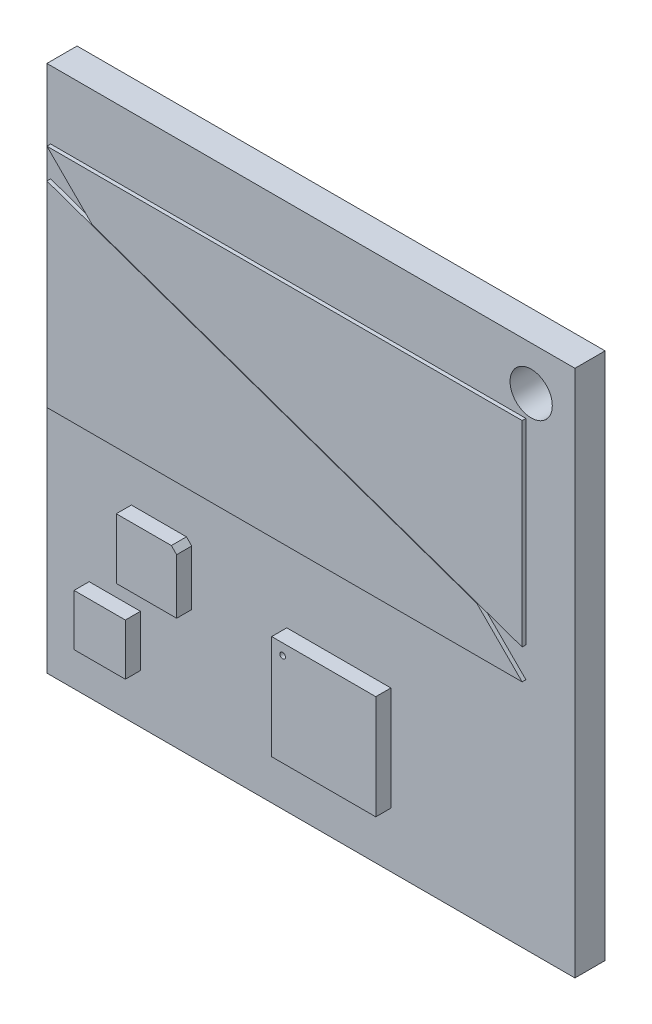
ISO-10303-21;
HEADER;
FILE_DESCRIPTION(('STEP AP214'),'2;1');
FILE_NAME('part.step','',(''),(''),'','','');
FILE_SCHEMA(('AUTOMOTIVE_DESIGN { 1 0 10303 214 1 1 1 1 }'));
ENDSEC;
DATA;
#1=APPLICATION_CONTEXT('core data for automotive mechanical design processes');
#2=APPLICATION_PROTOCOL_DEFINITION('international standard','automotive_design',2000,#1);
#3=PRODUCT_CONTEXT('',#1,'mechanical');
#4=PRODUCT('Part','Part','',(#3));
#5=PRODUCT_RELATED_PRODUCT_CATEGORY('part','',(#4));
#6=PRODUCT_DEFINITION_FORMATION('','',#4);
#7=PRODUCT_DEFINITION_CONTEXT('part definition',#1,'design');
#8=PRODUCT_DEFINITION('design','',#6,#7);
#9=PRODUCT_DEFINITION_SHAPE('','',#8);
#10=(LENGTH_UNIT() NAMED_UNIT(*) SI_UNIT(.MILLI.,.METRE.));
#11=(NAMED_UNIT(*) PLANE_ANGLE_UNIT() SI_UNIT($,.RADIAN.));
#12=(NAMED_UNIT(*) SI_UNIT($,.STERADIAN.) SOLID_ANGLE_UNIT());
#13=UNCERTAINTY_MEASURE_WITH_UNIT(LENGTH_MEASURE(1.E-05),#10,'distance_accuracy_value','');
#14=(GEOMETRIC_REPRESENTATION_CONTEXT(3) GLOBAL_UNCERTAINTY_ASSIGNED_CONTEXT((#13)) GLOBAL_UNIT_ASSIGNED_CONTEXT((#10,
#11,#12)) REPRESENTATION_CONTEXT('',''));
#15=CARTESIAN_POINT('',(0.,0.,0.));
#16=DIRECTION('',(0.,0.,1.));
#17=DIRECTION('',(1.,0.,0.));
#18=AXIS2_PLACEMENT_3D('',#15,#16,#17);
#19=CARTESIAN_POINT('',(0.,0.,0.));
#20=DIRECTION('',(0.,0.,1.));
#21=DIRECTION('',(1.,0.,0.));
#22=AXIS2_PLACEMENT_3D('',#19,#20,#21);
#23=PLANE('',#22);
#24=DIRECTION('',(1.,0.,0.));
#25=VECTOR('',#24,1.);
#26=CARTESIAN_POINT('',(0.,6.65,0.));
#27=LINE('',#26,#25);
#28=CARTESIAN_POINT('',(2.8,6.65,0.));
#29=VERTEX_POINT('',#28);
#30=CARTESIAN_POINT('',(6.2,6.65,0.));
#31=VERTEX_POINT('',#30);
#32=EDGE_CURVE('E378',#29,#31,#27,.T.);
#33=ORIENTED_EDGE('',*,*,#32,.T.);
#34=DIRECTION('',(0.,1.,0.));
#35=VECTOR('',#34,1.);
#36=CARTESIAN_POINT('',(6.2,0.,0.));
#37=LINE('',#36,#35);
#38=CARTESIAN_POINT('',(6.2,3.25,0.));
#39=VERTEX_POINT('',#38);
#40=EDGE_CURVE('E384',#39,#31,#37,.T.);
#41=ORIENTED_EDGE('',*,*,#40,.F.);
#42=DIRECTION('',(1.,0.,0.));
#43=VECTOR('',#42,1.);
#44=CARTESIAN_POINT('',(0.,3.25,0.));
#45=LINE('',#44,#43);
#46=CARTESIAN_POINT('',(2.8,3.25,0.));
#47=VERTEX_POINT('',#46);
#48=EDGE_CURVE('E400',#47,#39,#45,.T.);
#49=ORIENTED_EDGE('',*,*,#48,.F.);
#50=DIRECTION('',(0.,-1.,0.));
#51=VECTOR('',#50,1.);
#52=CARTESIAN_POINT('',(2.8,0.,0.));
#53=LINE('',#52,#51);
#54=EDGE_CURVE('E397',#29,#47,#53,.T.);
#55=ORIENTED_EDGE('',*,*,#54,.F.);
#56=EDGE_LOOP('',(#33,#41,#49,#55));
#57=FACE_BOUND('',#56,.T.);
#58=CARTESIAN_POINT('',(32.1,32.1,0.));
#59=DIRECTION('',(0.,0.,1.));
#60=DIRECTION('',(1.,0.,0.));
#61=AXIS2_PLACEMENT_3D('',#58,#59,#60);
#62=CIRCLE('',#61,1.4);
#63=CARTESIAN_POINT('',(33.5,32.1,0.));
#64=VERTEX_POINT('',#63);
#65=EDGE_CURVE('E465',#64,#64,#62,.T.);
#66=ORIENTED_EDGE('',*,*,#65,.F.);
#67=EDGE_LOOP('',(#66));
#68=FACE_BOUND('',#67,.T.);
#69=DIRECTION('',(0.,1.,0.));
#70=VECTOR('',#69,1.);
#71=CARTESIAN_POINT('',(35.,0.,0.));
#72=LINE('',#71,#70);
#73=CARTESIAN_POINT('',(35.,0.,0.));
#74=VERTEX_POINT('',#73);
#75=CARTESIAN_POINT('',(35.,35.,0.));
#76=VERTEX_POINT('',#75);
#77=EDGE_CURVE('E470',#74,#76,#72,.T.);
#78=ORIENTED_EDGE('',*,*,#77,.T.);
#79=DIRECTION('',(-1.,0.,0.));
#80=VECTOR('',#79,1.);
#81=CARTESIAN_POINT('',(35.,35.,0.));
#82=LINE('',#81,#80);
#83=CARTESIAN_POINT('',(0.,35.,0.));
#84=VERTEX_POINT('',#83);
#85=EDGE_CURVE('E495',#76,#84,#82,.T.);
#86=ORIENTED_EDGE('',*,*,#85,.T.);
#87=DIRECTION('',(0.,-1.,0.));
#88=VECTOR('',#87,1.);
#89=CARTESIAN_POINT('',(0.,35.,0.));
#90=LINE('',#89,#88);
#91=CARTESIAN_POINT('',(0.,0.,0.));
#92=VERTEX_POINT('',#91);
#93=EDGE_CURVE('E499',#84,#92,#90,.T.);
#94=ORIENTED_EDGE('',*,*,#93,.T.);
#95=DIRECTION('',(1.,0.,0.));
#96=VECTOR('',#95,1.);
#97=CARTESIAN_POINT('',(0.,0.,0.));
#98=LINE('',#97,#96);
#99=EDGE_CURVE('E479',#92,#74,#98,.T.);
#100=ORIENTED_EDGE('',*,*,#99,.T.);
#101=EDGE_LOOP('',(#78,#86,#94,#100));
#102=FACE_BOUND('',#101,.T.);
#103=DIRECTION('',(0.,1.,0.));
#104=VECTOR('',#103,1.);
#105=CARTESIAN_POINT('',(22.8,0.,0.));
#106=LINE('',#105,#104);
#107=CARTESIAN_POINT('',(22.8,3.65,0.));
#108=VERTEX_POINT('',#107);
#109=CARTESIAN_POINT('',(22.8,10.55,0.));
#110=VERTEX_POINT('',#109);
#111=EDGE_CURVE('E442',#108,#110,#106,.T.);
#112=ORIENTED_EDGE('',*,*,#111,.F.);
#113=DIRECTION('',(1.,0.,0.));
#114=VECTOR('',#113,1.);
#115=CARTESIAN_POINT('',(0.,3.65,0.));
#116=LINE('',#115,#114);
#117=CARTESIAN_POINT('',(15.9,3.65,0.));
#118=VERTEX_POINT('',#117);
#119=EDGE_CURVE('E418',#118,#108,#116,.T.);
#120=ORIENTED_EDGE('',*,*,#119,.F.);
#121=DIRECTION('',(0.,-1.,0.));
#122=VECTOR('',#121,1.);
#123=CARTESIAN_POINT('',(15.9,0.,0.));
#124=LINE('',#123,#122);
#125=CARTESIAN_POINT('',(15.9,10.55,0.));
#126=VERTEX_POINT('',#125);
#127=EDGE_CURVE('E424',#126,#118,#124,.T.);
#128=ORIENTED_EDGE('',*,*,#127,.F.);
#129=DIRECTION('',(1.,0.,0.));
#130=VECTOR('',#129,1.);
#131=CARTESIAN_POINT('',(0.,10.55,0.));
#132=LINE('',#131,#130);
#133=EDGE_CURVE('E446',#126,#110,#132,.T.);
#134=ORIENTED_EDGE('',*,*,#133,.T.);
#135=EDGE_LOOP('',(#112,#120,#128,#134));
#136=FACE_BOUND('',#135,.T.);
#137=DIRECTION('',(0.,1.,0.));
#138=VECTOR('',#137,1.);
#139=CARTESIAN_POINT('',(5.6,0.,0.));
#140=LINE('',#139,#138);
#141=CARTESIAN_POINT('',(5.6,8.45,0.));
#142=VERTEX_POINT('',#141);
#143=CARTESIAN_POINT('',(5.6,12.45,0.));
#144=VERTEX_POINT('',#143);
#145=EDGE_CURVE('E350',#142,#144,#140,.T.);
#146=ORIENTED_EDGE('',*,*,#145,.T.);
#147=DIRECTION('',(-1.,0.,0.));
#148=VECTOR('',#147,1.);
#149=CARTESIAN_POINT('',(0.,12.45,0.));
#150=LINE('',#149,#148);
#151=CARTESIAN_POINT('',(9.25,12.45,0.));
#152=VERTEX_POINT('',#151);
#153=EDGE_CURVE('E327',#152,#144,#150,.T.);
#154=ORIENTED_EDGE('',*,*,#153,.F.);
#155=DIRECTION('',(-0.707106781186548,0.707106781186548,0.));
#156=VECTOR('',#155,1.);
#157=CARTESIAN_POINT('',(10.85,10.85,0.));
#158=LINE('',#157,#156);
#159=CARTESIAN_POINT('',(9.6,12.1,0.));
#160=VERTEX_POINT('',#159);
#161=EDGE_CURVE('E332',#160,#152,#158,.T.);
#162=ORIENTED_EDGE('',*,*,#161,.F.);
#163=DIRECTION('',(0.,1.,0.));
#164=VECTOR('',#163,1.);
#165=CARTESIAN_POINT('',(9.59999999999996,0.,0.));
#166=LINE('',#165,#164);
#167=CARTESIAN_POINT('',(9.6,8.45,0.));
#168=VERTEX_POINT('',#167);
#169=EDGE_CURVE('E358',#168,#160,#166,.T.);
#170=ORIENTED_EDGE('',*,*,#169,.F.);
#171=DIRECTION('',(-1.,0.,0.));
#172=VECTOR('',#171,1.);
#173=CARTESIAN_POINT('',(0.,8.45,0.));
#174=LINE('',#173,#172);
#175=EDGE_CURVE('E354',#168,#142,#174,.T.);
#176=ORIENTED_EDGE('',*,*,#175,.T.);
#177=EDGE_LOOP('',(#146,#154,#162,#170,#176));
#178=FACE_BOUND('',#177,.T.);
#179=DIRECTION('',(0.943599982132881,-0.331087713029081,0.));
#180=VECTOR('',#179,1.);
#181=CARTESIAN_POINT('',(8.94765689229926,25.5008221430529,0.));
#182=LINE('',#181,#180);
#183=CARTESIAN_POINT('',(3.25,27.5,0.));
#184=VERTEX_POINT('',#183);
#185=CARTESIAN_POINT('',(31.75,17.5,0.));
#186=VERTEX_POINT('',#185);
#187=EDGE_CURVE('E303',#184,#186,#182,.T.);
#188=ORIENTED_EDGE('',*,*,#187,.F.);
#189=DIRECTION('',(0.707106781186548,-0.707106781186547,0.));
#190=VECTOR('',#189,1.);
#191=CARTESIAN_POINT('',(15.375,15.375,0.));
#192=LINE('',#191,#190);
#193=CARTESIAN_POINT('',(0.25,30.5,0.));
#194=VERTEX_POINT('',#193);
#195=EDGE_CURVE('E252',#194,#184,#192,.T.);
#196=ORIENTED_EDGE('',*,*,#195,.F.);
#197=DIRECTION('',(1.,0.,0.));
#198=VECTOR('',#197,1.);
#199=CARTESIAN_POINT('',(0.,30.5,0.));
#200=LINE('',#199,#198);
#201=CARTESIAN_POINT('',(31.75,30.5,0.));
#202=VERTEX_POINT('',#201);
#203=EDGE_CURVE('E288',#194,#202,#200,.T.);
#204=ORIENTED_EDGE('',*,*,#203,.T.);
#205=DIRECTION('',(0.,-1.,0.));
#206=VECTOR('',#205,1.);
#207=CARTESIAN_POINT('',(31.75,0.,0.));
#208=LINE('',#207,#206);
#209=EDGE_CURVE('E307',#202,#186,#208,.T.);
#210=ORIENTED_EDGE('',*,*,#209,.T.);
#211=EDGE_LOOP('',(#188,#196,#204,#210));
#212=FACE_BOUND('',#211,.T.);
#213=DIRECTION('',(0.707106781186547,-0.707106781186548,0.));
#214=VECTOR('',#213,1.);
#215=CARTESIAN_POINT('',(23.625,23.625,0.));
#216=LINE('',#215,#214);
#217=CARTESIAN_POINT('',(28.75,18.5,0.));
#218=VERTEX_POINT('',#217);
#219=CARTESIAN_POINT('',(31.75,15.5,0.));
#220=VERTEX_POINT('',#219);
#221=EDGE_CURVE('E80',#218,#220,#216,.T.);
#222=ORIENTED_EDGE('',*,*,#221,.T.);
#223=DIRECTION('',(1.,0.,0.));
#224=VECTOR('',#223,1.);
#225=CARTESIAN_POINT('',(0.,15.5,0.));
#226=LINE('',#225,#224);
#227=CARTESIAN_POINT('',(0.25,15.5,0.));
#228=VERTEX_POINT('',#227);
#229=EDGE_CURVE('E249',#228,#220,#226,.T.);
#230=ORIENTED_EDGE('',*,*,#229,.F.);
#231=DIRECTION('',(0.,1.,0.));
#232=VECTOR('',#231,1.);
#233=CARTESIAN_POINT('',(0.25,0.,0.));
#234=LINE('',#233,#232);
#235=CARTESIAN_POINT('',(0.25,28.5,0.));
#236=VERTEX_POINT('',#235);
#237=EDGE_CURVE('E244',#228,#236,#234,.T.);
#238=ORIENTED_EDGE('',*,*,#237,.T.);
#239=DIRECTION('',(0.943599982132881,-0.331087713029081,0.));
#240=VECTOR('',#239,1.);
#241=CARTESIAN_POINT('',(8.93121403124143,25.4539599890381,0.));
#242=LINE('',#241,#240);
#243=EDGE_CURVE('E85',#236,#218,#242,.T.);
#244=ORIENTED_EDGE('',*,*,#243,.T.);
#245=EDGE_LOOP('',(#222,#230,#238,#244));
#246=FACE_BOUND('',#245,.T.);
#247=ADVANCED_FACE('F64',(#57,#68,#102,#136,#178,#212,#246),#23,.T.);
#248=CARTESIAN_POINT('',(35.,0.,-2.));
#249=DIRECTION('',(1.,0.,0.));
#250=DIRECTION('',(0.,0.,-1.));
#251=AXIS2_PLACEMENT_3D('',#248,#249,#250);
#252=PLANE('',#251);
#253=ORIENTED_EDGE('',*,*,#77,.F.);
#254=DIRECTION('',(0.,0.,1.));
#255=VECTOR('',#254,1.);
#256=CARTESIAN_POINT('',(35.,0.,-2.));
#257=LINE('',#256,#255);
#258=CARTESIAN_POINT('',(35.,0.,-2.));
#259=VERTEX_POINT('',#258);
#260=EDGE_CURVE('E73',#259,#74,#257,.T.);
#261=ORIENTED_EDGE('',*,*,#260,.F.);
#262=DIRECTION('',(0.,1.,0.));
#263=VECTOR('',#262,1.);
#264=CARTESIAN_POINT('',(35.,0.,-2.));
#265=LINE('',#264,#263);
#266=CARTESIAN_POINT('',(35.,35.,-2.));
#267=VERTEX_POINT('',#266);
#268=EDGE_CURVE('E474',#259,#267,#265,.T.);
#269=ORIENTED_EDGE('',*,*,#268,.T.);
#270=DIRECTION('',(0.,0.,1.));
#271=VECTOR('',#270,1.);
#272=CARTESIAN_POINT('',(35.,35.,-2.));
#273=LINE('',#272,#271);
#274=EDGE_CURVE('E491',#267,#76,#273,.T.);
#275=ORIENTED_EDGE('',*,*,#274,.T.);
#276=EDGE_LOOP('',(#253,#261,#269,#275));
#277=FACE_BOUND('',#276,.T.);
#278=ADVANCED_FACE('F66',(#277),#252,.T.);
#279=CARTESIAN_POINT('',(0.,0.,-2.));
#280=DIRECTION('',(0.,-1.,0.));
#281=DIRECTION('',(0.,0.,-1.));
#282=AXIS2_PLACEMENT_3D('',#279,#280,#281);
#283=PLANE('',#282);
#284=ORIENTED_EDGE('',*,*,#99,.F.);
#285=DIRECTION('',(0.,0.,1.));
#286=VECTOR('',#285,1.);
#287=CARTESIAN_POINT('',(0.,0.,-2.));
#288=LINE('',#287,#286);
#289=CARTESIAN_POINT('',(0.,0.,-2.));
#290=VERTEX_POINT('',#289);
#291=EDGE_CURVE('E508',#290,#92,#288,.T.);
#292=ORIENTED_EDGE('',*,*,#291,.F.);
#293=DIRECTION('',(1.,0.,0.));
#294=VECTOR('',#293,1.);
#295=CARTESIAN_POINT('',(0.,0.,-2.));
#296=LINE('',#295,#294);
#297=EDGE_CURVE('E487',#290,#259,#296,.T.);
#298=ORIENTED_EDGE('',*,*,#297,.T.);
#299=ORIENTED_EDGE('',*,*,#260,.T.);
#300=EDGE_LOOP('',(#284,#292,#298,#299));
#301=FACE_BOUND('',#300,.T.);
#302=ADVANCED_FACE('F526',(#301),#283,.T.);
#303=CARTESIAN_POINT('',(0.,35.,-2.));
#304=DIRECTION('',(-1.,0.,0.));
#305=DIRECTION('',(0.,0.,1.));
#306=AXIS2_PLACEMENT_3D('',#303,#304,#305);
#307=PLANE('',#306);
#308=ORIENTED_EDGE('',*,*,#93,.F.);
#309=DIRECTION('',(0.,0.,1.));
#310=VECTOR('',#309,1.);
#311=CARTESIAN_POINT('',(0.,35.,-2.));
#312=LINE('',#311,#310);
#313=CARTESIAN_POINT('',(0.,35.,-2.));
#314=VERTEX_POINT('',#313);
#315=EDGE_CURVE('E511',#314,#84,#312,.T.);
#316=ORIENTED_EDGE('',*,*,#315,.F.);
#317=DIRECTION('',(0.,-1.,0.));
#318=VECTOR('',#317,1.);
#319=CARTESIAN_POINT('',(0.,35.,-2.));
#320=LINE('',#319,#318);
#321=EDGE_CURVE('E483',#314,#290,#320,.T.);
#322=ORIENTED_EDGE('',*,*,#321,.T.);
#323=ORIENTED_EDGE('',*,*,#291,.T.);
#324=EDGE_LOOP('',(#308,#316,#322,#323));
#325=FACE_BOUND('',#324,.T.);
#326=ADVANCED_FACE('F532',(#325),#307,.T.);
#327=CARTESIAN_POINT('',(35.,35.,-2.));
#328=DIRECTION('',(0.,1.,0.));
#329=DIRECTION('',(0.,0.,1.));
#330=AXIS2_PLACEMENT_3D('',#327,#328,#329);
#331=PLANE('',#330);
#332=ORIENTED_EDGE('',*,*,#85,.F.);
#333=ORIENTED_EDGE('',*,*,#274,.F.);
#334=DIRECTION('',(-1.,0.,0.));
#335=VECTOR('',#334,1.);
#336=CARTESIAN_POINT('',(35.,35.,-2.));
#337=LINE('',#336,#335);
#338=EDGE_CURVE('E478',#267,#314,#337,.T.);
#339=ORIENTED_EDGE('',*,*,#338,.T.);
#340=ORIENTED_EDGE('',*,*,#315,.T.);
#341=EDGE_LOOP('',(#332,#333,#339,#340));
#342=FACE_BOUND('',#341,.T.);
#343=ADVANCED_FACE('F520',(#342),#331,.T.);
#344=CARTESIAN_POINT('',(0.,0.,-2.));
#345=DIRECTION('',(0.,0.,1.));
#346=DIRECTION('',(1.,0.,0.));
#347=AXIS2_PLACEMENT_3D('',#344,#345,#346);
#348=PLANE('',#347);
#349=CARTESIAN_POINT('',(32.1,32.1,-2.));
#350=DIRECTION('',(0.,0.,1.));
#351=DIRECTION('',(1.,0.,0.));
#352=AXIS2_PLACEMENT_3D('',#349,#350,#351);
#353=CIRCLE('',#352,1.4);
#354=CARTESIAN_POINT('',(33.5,32.1,-2.));
#355=VERTEX_POINT('',#354);
#356=EDGE_CURVE('E466',#355,#355,#353,.T.);
#357=ORIENTED_EDGE('',*,*,#356,.T.);
#358=EDGE_LOOP('',(#357));
#359=FACE_BOUND('',#358,.T.);
#360=ORIENTED_EDGE('',*,*,#268,.F.);
#361=ORIENTED_EDGE('',*,*,#297,.F.);
#362=ORIENTED_EDGE('',*,*,#321,.F.);
#363=ORIENTED_EDGE('',*,*,#338,.F.);
#364=EDGE_LOOP('',(#360,#361,#362,#363));
#365=FACE_BOUND('',#364,.T.);
#366=ADVANCED_FACE('F529',(#359,#365),#348,.F.);
#367=CARTESIAN_POINT('',(32.1,32.1,-2.));
#368=DIRECTION('',(0.,0.,1.));
#369=DIRECTION('',(1.,0.,0.));
#370=AXIS2_PLACEMENT_3D('',#367,#368,#369);
#371=CYLINDRICAL_SURFACE('',#370,1.4);
#372=ORIENTED_EDGE('',*,*,#356,.F.);
#373=EDGE_LOOP('',(#372));
#374=FACE_BOUND('',#373,.T.);
#375=ORIENTED_EDGE('',*,*,#65,.T.);
#376=EDGE_LOOP('',(#375));
#377=FACE_BOUND('',#376,.T.);
#378=ADVANCED_FACE('F583',(#374,#377),#371,.F.);
#379=CARTESIAN_POINT('',(0.,3.65,1.));
#380=DIRECTION('',(0.,1.,0.));
#381=DIRECTION('',(0.,0.,1.));
#382=AXIS2_PLACEMENT_3D('',#379,#380,#381);
#383=PLANE('',#382);
#384=ORIENTED_EDGE('',*,*,#119,.T.);
#385=DIRECTION('',(0.,0.,-1.));
#386=VECTOR('',#385,1.);
#387=CARTESIAN_POINT('',(22.8,3.65,1.));
#388=LINE('',#387,#386);
#389=CARTESIAN_POINT('',(22.8,3.65,1.));
#390=VERTEX_POINT('',#389);
#391=EDGE_CURVE('E462',#390,#108,#388,.T.);
#392=ORIENTED_EDGE('',*,*,#391,.F.);
#393=DIRECTION('',(1.,0.,0.));
#394=VECTOR('',#393,1.);
#395=CARTESIAN_POINT('',(0.,3.65,1.));
#396=LINE('',#395,#394);
#397=CARTESIAN_POINT('',(15.9,3.65,1.));
#398=VERTEX_POINT('',#397);
#399=EDGE_CURVE('E423',#398,#390,#396,.T.);
#400=ORIENTED_EDGE('',*,*,#399,.F.);
#401=DIRECTION('',(0.,0.,-1.));
#402=VECTOR('',#401,1.);
#403=CARTESIAN_POINT('',(15.9,3.65,1.));
#404=LINE('',#403,#402);
#405=EDGE_CURVE('E438',#398,#118,#404,.T.);
#406=ORIENTED_EDGE('',*,*,#405,.T.);
#407=EDGE_LOOP('',(#384,#392,#400,#406));
#408=FACE_BOUND('',#407,.T.);
#409=ADVANCED_FACE('F581',(#408),#383,.F.);
#410=CARTESIAN_POINT('',(22.8,0.,1.));
#411=DIRECTION('',(-1.,0.,0.));
#412=DIRECTION('',(0.,0.,1.));
#413=AXIS2_PLACEMENT_3D('',#410,#411,#412);
#414=PLANE('',#413);
#415=ORIENTED_EDGE('',*,*,#111,.T.);
#416=DIRECTION('',(0.,0.,-1.));
#417=VECTOR('',#416,1.);
#418=CARTESIAN_POINT('',(22.8,10.55,1.));
#419=LINE('',#418,#417);
#420=CARTESIAN_POINT('',(22.8,10.55,1.));
#421=VERTEX_POINT('',#420);
#422=EDGE_CURVE('E459',#421,#110,#419,.T.);
#423=ORIENTED_EDGE('',*,*,#422,.F.);
#424=DIRECTION('',(0.,1.,0.));
#425=VECTOR('',#424,1.);
#426=CARTESIAN_POINT('',(22.8,0.,1.));
#427=LINE('',#426,#425);
#428=EDGE_CURVE('E428',#390,#421,#427,.T.);
#429=ORIENTED_EDGE('',*,*,#428,.F.);
#430=ORIENTED_EDGE('',*,*,#391,.T.);
#431=EDGE_LOOP('',(#415,#423,#429,#430));
#432=FACE_BOUND('',#431,.T.);
#433=ADVANCED_FACE('F576',(#432),#414,.F.);
#434=CARTESIAN_POINT('',(0.,10.55,1.));
#435=DIRECTION('',(0.,1.,0.));
#436=DIRECTION('',(0.,0.,1.));
#437=AXIS2_PLACEMENT_3D('',#434,#435,#436);
#438=PLANE('',#437);
#439=ORIENTED_EDGE('',*,*,#133,.F.);
#440=DIRECTION('',(0.,0.,-1.));
#441=VECTOR('',#440,1.);
#442=CARTESIAN_POINT('',(15.9,10.55,1.));
#443=LINE('',#442,#441);
#444=CARTESIAN_POINT('',(15.9,10.55,1.));
#445=VERTEX_POINT('',#444);
#446=EDGE_CURVE('E455',#445,#126,#443,.T.);
#447=ORIENTED_EDGE('',*,*,#446,.F.);
#448=DIRECTION('',(1.,0.,0.));
#449=VECTOR('',#448,1.);
#450=CARTESIAN_POINT('',(0.,10.55,1.));
#451=LINE('',#450,#449);
#452=EDGE_CURVE('E431',#445,#421,#451,.T.);
#453=ORIENTED_EDGE('',*,*,#452,.T.);
#454=ORIENTED_EDGE('',*,*,#422,.T.);
#455=EDGE_LOOP('',(#439,#447,#453,#454));
#456=FACE_BOUND('',#455,.T.);
#457=ADVANCED_FACE('F567',(#456),#438,.T.);
#458=CARTESIAN_POINT('',(16.63,9.82,1.));
#459=DIRECTION('',(0.,0.,-1.));
#460=DIRECTION('',(-1.,0.,0.));
#461=AXIS2_PLACEMENT_3D('',#458,#459,#460);
#462=CYLINDRICAL_SURFACE('',#461,0.1855);
#463=CARTESIAN_POINT('',(16.63,9.82,1.));
#464=DIRECTION('',(0.,0.,1.));
#465=DIRECTION('',(1.,0.,0.));
#466=AXIS2_PLACEMENT_3D('',#463,#464,#465);
#467=CIRCLE('',#466,0.1855);
#468=CARTESIAN_POINT('',(16.8155,9.82,1.));
#469=VERTEX_POINT('',#468);
#470=EDGE_CURVE('E419',#469,#469,#467,.T.);
#471=ORIENTED_EDGE('',*,*,#470,.T.);
#472=EDGE_LOOP('',(#471));
#473=FACE_BOUND('',#472,.T.);
#474=CARTESIAN_POINT('',(16.63,9.82,0.));
#475=DIRECTION('',(0.,0.,1.));
#476=DIRECTION('',(1.,0.,0.));
#477=AXIS2_PLACEMENT_3D('',#474,#475,#476);
#478=CIRCLE('',#477,0.1855);
#479=CARTESIAN_POINT('',(16.8155,9.82,0.));
#480=VERTEX_POINT('',#479);
#481=EDGE_CURVE('E12',#480,#480,#478,.F.);
#482=ORIENTED_EDGE('',*,*,#481,.T.);
#483=EDGE_LOOP('',(#482));
#484=FACE_BOUND('',#483,.T.);
#485=ADVANCED_FACE('F565',(#473,#484),#462,.F.);
#486=CARTESIAN_POINT('',(15.9,0.,1.));
#487=DIRECTION('',(1.,0.,0.));
#488=DIRECTION('',(0.,0.,-1.));
#489=AXIS2_PLACEMENT_3D('',#486,#487,#488);
#490=PLANE('',#489);
#491=ORIENTED_EDGE('',*,*,#127,.T.);
#492=ORIENTED_EDGE('',*,*,#405,.F.);
#493=DIRECTION('',(0.,-1.,0.));
#494=VECTOR('',#493,1.);
#495=CARTESIAN_POINT('',(15.9,0.,1.));
#496=LINE('',#495,#494);
#497=EDGE_CURVE('E435',#445,#398,#496,.T.);
#498=ORIENTED_EDGE('',*,*,#497,.F.);
#499=ORIENTED_EDGE('',*,*,#446,.T.);
#500=EDGE_LOOP('',(#491,#492,#498,#499));
#501=FACE_BOUND('',#500,.T.);
#502=ADVANCED_FACE('F560',(#501),#490,.F.);
#503=CARTESIAN_POINT('',(0.,0.,1.));
#504=DIRECTION('',(0.,0.,1.));
#505=DIRECTION('',(1.,0.,0.));
#506=AXIS2_PLACEMENT_3D('',#503,#504,#505);
#507=PLANE('',#506);
#508=ORIENTED_EDGE('',*,*,#470,.F.);
#509=EDGE_LOOP('',(#508));
#510=FACE_BOUND('',#509,.T.);
#511=ORIENTED_EDGE('',*,*,#399,.T.);
#512=ORIENTED_EDGE('',*,*,#428,.T.);
#513=ORIENTED_EDGE('',*,*,#452,.F.);
#514=ORIENTED_EDGE('',*,*,#497,.T.);
#515=EDGE_LOOP('',(#511,#512,#513,#514));
#516=FACE_BOUND('',#515,.T.);
#517=ADVANCED_FACE('F551',(#510,#516),#507,.T.);
#518=ORIENTED_EDGE('',*,*,#481,.F.);
#519=EDGE_LOOP('',(#518));
#520=FACE_BOUND('',#519,.T.);
#521=ADVANCED_FACE('F543',(#520),#23,.T.);
#522=CARTESIAN_POINT('',(0.,6.65,1.));
#523=DIRECTION('',(0.,1.,0.));
#524=DIRECTION('',(0.,0.,1.));
#525=AXIS2_PLACEMENT_3D('',#522,#523,#524);
#526=PLANE('',#525);
#527=ORIENTED_EDGE('',*,*,#32,.F.);
#528=DIRECTION('',(0.,0.,-1.));
#529=VECTOR('',#528,1.);
#530=CARTESIAN_POINT('',(2.8,6.65,1.));
#531=LINE('',#530,#529);
#532=CARTESIAN_POINT('',(2.8,6.65,1.));
#533=VERTEX_POINT('',#532);
#534=EDGE_CURVE('E415',#533,#29,#531,.T.);
#535=ORIENTED_EDGE('',*,*,#534,.F.);
#536=DIRECTION('',(1.,0.,0.));
#537=VECTOR('',#536,1.);
#538=CARTESIAN_POINT('',(0.,6.65,1.));
#539=LINE('',#538,#537);
#540=CARTESIAN_POINT('',(6.2,6.65,1.));
#541=VERTEX_POINT('',#540);
#542=EDGE_CURVE('E379',#533,#541,#539,.T.);
#543=ORIENTED_EDGE('',*,*,#542,.T.);
#544=DIRECTION('',(0.,0.,-1.));
#545=VECTOR('',#544,1.);
#546=CARTESIAN_POINT('',(6.2,6.65,1.));
#547=LINE('',#546,#545);
#548=EDGE_CURVE('E393',#541,#31,#547,.T.);
#549=ORIENTED_EDGE('',*,*,#548,.T.);
#550=EDGE_LOOP('',(#527,#535,#543,#549));
#551=FACE_BOUND('',#550,.T.);
#552=ADVANCED_FACE('F550',(#551),#526,.T.);
#553=CARTESIAN_POINT('',(2.8,0.,1.));
#554=DIRECTION('',(1.,0.,0.));
#555=DIRECTION('',(0.,1.,0.));
#556=AXIS2_PLACEMENT_3D('',#553,#554,#555);
#557=PLANE('',#556);
#558=ORIENTED_EDGE('',*,*,#54,.T.);
#559=DIRECTION('',(0.,0.,-1.));
#560=VECTOR('',#559,1.);
#561=CARTESIAN_POINT('',(2.8,3.25,1.));
#562=LINE('',#561,#560);
#563=CARTESIAN_POINT('',(2.8,3.25,1.));
#564=VERTEX_POINT('',#563);
#565=EDGE_CURVE('E411',#564,#47,#562,.T.);
#566=ORIENTED_EDGE('',*,*,#565,.F.);
#567=DIRECTION('',(0.,-1.,0.));
#568=VECTOR('',#567,1.);
#569=CARTESIAN_POINT('',(2.8,0.,1.));
#570=LINE('',#569,#568);
#571=EDGE_CURVE('E383',#533,#564,#570,.T.);
#572=ORIENTED_EDGE('',*,*,#571,.F.);
#573=ORIENTED_EDGE('',*,*,#534,.T.);
#574=EDGE_LOOP('',(#558,#566,#572,#573));
#575=FACE_BOUND('',#574,.T.);
#576=ADVANCED_FACE('F557',(#575),#557,.F.);
#577=CARTESIAN_POINT('',(0.,3.25,1.));
#578=DIRECTION('',(0.,1.,0.));
#579=DIRECTION('',(0.,0.,1.));
#580=AXIS2_PLACEMENT_3D('',#577,#578,#579);
#581=PLANE('',#580);
#582=ORIENTED_EDGE('',*,*,#48,.T.);
#583=DIRECTION('',(0.,0.,-1.));
#584=VECTOR('',#583,1.);
#585=CARTESIAN_POINT('',(6.2,3.25,1.));
#586=LINE('',#585,#584);
#587=CARTESIAN_POINT('',(6.2,3.25,1.));
#588=VERTEX_POINT('',#587);
#589=EDGE_CURVE('E408',#588,#39,#586,.T.);
#590=ORIENTED_EDGE('',*,*,#589,.F.);
#591=DIRECTION('',(1.,0.,0.));
#592=VECTOR('',#591,1.);
#593=CARTESIAN_POINT('',(0.,3.25,1.));
#594=LINE('',#593,#592);
#595=EDGE_CURVE('E387',#564,#588,#594,.T.);
#596=ORIENTED_EDGE('',*,*,#595,.F.);
#597=ORIENTED_EDGE('',*,*,#565,.T.);
#598=EDGE_LOOP('',(#582,#590,#596,#597));
#599=FACE_BOUND('',#598,.T.);
#600=ADVANCED_FACE('F639',(#599),#581,.F.);
#601=CARTESIAN_POINT('',(6.2,0.,1.));
#602=DIRECTION('',(-1.,0.,0.));
#603=DIRECTION('',(0.,0.,1.));
#604=AXIS2_PLACEMENT_3D('',#601,#602,#603);
#605=PLANE('',#604);
#606=ORIENTED_EDGE('',*,*,#40,.T.);
#607=ORIENTED_EDGE('',*,*,#548,.F.);
#608=DIRECTION('',(0.,1.,0.));
#609=VECTOR('',#608,1.);
#610=CARTESIAN_POINT('',(6.2,0.,1.));
#611=LINE('',#610,#609);
#612=EDGE_CURVE('E390',#588,#541,#611,.T.);
#613=ORIENTED_EDGE('',*,*,#612,.F.);
#614=ORIENTED_EDGE('',*,*,#589,.T.);
#615=EDGE_LOOP('',(#606,#607,#613,#614));
#616=FACE_BOUND('',#615,.T.);
#617=ADVANCED_FACE('F648',(#616),#605,.F.);
#618=CARTESIAN_POINT('',(0.,0.,1.));
#619=DIRECTION('',(0.,0.,1.));
#620=DIRECTION('',(1.,0.,0.));
#621=AXIS2_PLACEMENT_3D('',#618,#619,#620);
#622=PLANE('',#621);
#623=ORIENTED_EDGE('',*,*,#542,.F.);
#624=ORIENTED_EDGE('',*,*,#571,.T.);
#625=ORIENTED_EDGE('',*,*,#595,.T.);
#626=ORIENTED_EDGE('',*,*,#612,.T.);
#627=EDGE_LOOP('',(#623,#624,#625,#626));
#628=FACE_BOUND('',#627,.T.);
#629=ADVANCED_FACE('F657',(#628),#622,.T.);
#630=CARTESIAN_POINT('',(0.,12.45,1.));
#631=DIRECTION('',(0.,-1.,0.));
#632=DIRECTION('',(0.,0.,-1.));
#633=AXIS2_PLACEMENT_3D('',#630,#631,#632);
#634=PLANE('',#633);
#635=ORIENTED_EDGE('',*,*,#153,.T.);
#636=DIRECTION('',(0.,0.,-1.));
#637=VECTOR('',#636,1.);
#638=CARTESIAN_POINT('',(5.6,12.45,1.));
#639=LINE('',#638,#637);
#640=CARTESIAN_POINT('',(5.6,12.45,1.));
#641=VERTEX_POINT('',#640);
#642=EDGE_CURVE('E375',#641,#144,#639,.T.);
#643=ORIENTED_EDGE('',*,*,#642,.F.);
#644=DIRECTION('',(-1.,0.,0.));
#645=VECTOR('',#644,1.);
#646=CARTESIAN_POINT('',(0.,12.45,1.));
#647=LINE('',#646,#645);
#648=CARTESIAN_POINT('',(9.25,12.45,1.));
#649=VERTEX_POINT('',#648);
#650=EDGE_CURVE('E328',#649,#641,#647,.T.);
#651=ORIENTED_EDGE('',*,*,#650,.F.);
#652=DIRECTION('',(0.,0.,-1.));
#653=VECTOR('',#652,1.);
#654=CARTESIAN_POINT('',(9.25,12.45,1.));
#655=LINE('',#654,#653);
#656=EDGE_CURVE('E346',#649,#152,#655,.T.);
#657=ORIENTED_EDGE('',*,*,#656,.T.);
#658=EDGE_LOOP('',(#635,#643,#651,#657));
#659=FACE_BOUND('',#658,.T.);
#660=ADVANCED_FACE('F666',(#659),#634,.F.);
#661=CARTESIAN_POINT('',(5.6,0.,1.));
#662=DIRECTION('',(-1.,0.,0.));
#663=DIRECTION('',(0.,0.,1.));
#664=AXIS2_PLACEMENT_3D('',#661,#662,#663);
#665=PLANE('',#664);
#666=ORIENTED_EDGE('',*,*,#145,.F.);
#667=DIRECTION('',(0.,0.,-1.));
#668=VECTOR('',#667,1.);
#669=CARTESIAN_POINT('',(5.6,8.45,1.));
#670=LINE('',#669,#668);
#671=CARTESIAN_POINT('',(5.6,8.45,1.));
#672=VERTEX_POINT('',#671);
#673=EDGE_CURVE('E372',#672,#142,#670,.T.);
#674=ORIENTED_EDGE('',*,*,#673,.F.);
#675=DIRECTION('',(0.,1.,0.));
#676=VECTOR('',#675,1.);
#677=CARTESIAN_POINT('',(5.6,0.,1.));
#678=LINE('',#677,#676);
#679=EDGE_CURVE('E331',#672,#641,#678,.T.);
#680=ORIENTED_EDGE('',*,*,#679,.T.);
#681=ORIENTED_EDGE('',*,*,#642,.T.);
#682=EDGE_LOOP('',(#666,#674,#680,#681));
#683=FACE_BOUND('',#682,.T.);
#684=ADVANCED_FACE('F675',(#683),#665,.T.);
#685=CARTESIAN_POINT('',(0.,8.45,1.));
#686=DIRECTION('',(0.,-1.,0.));
#687=DIRECTION('',(0.,0.,-1.));
#688=AXIS2_PLACEMENT_3D('',#685,#686,#687);
#689=PLANE('',#688);
#690=ORIENTED_EDGE('',*,*,#175,.F.);
#691=DIRECTION('',(0.,0.,-1.));
#692=VECTOR('',#691,1.);
#693=CARTESIAN_POINT('',(9.6,8.45,1.));
#694=LINE('',#693,#692);
#695=CARTESIAN_POINT('',(9.6,8.45,1.));
#696=VERTEX_POINT('',#695);
#697=EDGE_CURVE('E369',#696,#168,#694,.T.);
#698=ORIENTED_EDGE('',*,*,#697,.F.);
#699=DIRECTION('',(-1.,0.,0.));
#700=VECTOR('',#699,1.);
#701=CARTESIAN_POINT('',(0.,8.45,1.));
#702=LINE('',#701,#700);
#703=EDGE_CURVE('E336',#696,#672,#702,.T.);
#704=ORIENTED_EDGE('',*,*,#703,.T.);
#705=ORIENTED_EDGE('',*,*,#673,.T.);
#706=EDGE_LOOP('',(#690,#698,#704,#705));
#707=FACE_BOUND('',#706,.T.);
#708=ADVANCED_FACE('F684',(#707),#689,.T.);
#709=CARTESIAN_POINT('',(9.59999999999996,0.,1.));
#710=DIRECTION('',(-1.,0.,0.));
#711=DIRECTION('',(0.,-1.,0.));
#712=AXIS2_PLACEMENT_3D('',#709,#710,#711);
#713=PLANE('',#712);
#714=ORIENTED_EDGE('',*,*,#169,.T.);
#715=DIRECTION('',(0.,0.,-1.));
#716=VECTOR('',#715,1.);
#717=CARTESIAN_POINT('',(9.6,12.1,1.));
#718=LINE('',#717,#716);
#719=CARTESIAN_POINT('',(9.6,12.1,1.));
#720=VERTEX_POINT('',#719);
#721=EDGE_CURVE('E367',#720,#160,#718,.T.);
#722=ORIENTED_EDGE('',*,*,#721,.F.);
#723=DIRECTION('',(0.,1.,0.));
#724=VECTOR('',#723,1.);
#725=CARTESIAN_POINT('',(9.59999999999996,0.,1.));
#726=LINE('',#725,#724);
#727=EDGE_CURVE('E340',#696,#720,#726,.T.);
#728=ORIENTED_EDGE('',*,*,#727,.F.);
#729=ORIENTED_EDGE('',*,*,#697,.T.);
#730=EDGE_LOOP('',(#714,#722,#728,#729));
#731=FACE_BOUND('',#730,.T.);
#732=ADVANCED_FACE('F693',(#731),#713,.F.);
#733=CARTESIAN_POINT('',(10.85,10.85,1.));
#734=DIRECTION('',(-0.707106781186547,-0.707106781186547,0.));
#735=DIRECTION('',(0.707106781186548,-0.707106781186548,0.));
#736=AXIS2_PLACEMENT_3D('',#733,#734,#735);
#737=PLANE('',#736);
#738=ORIENTED_EDGE('',*,*,#161,.T.);
#739=ORIENTED_EDGE('',*,*,#656,.F.);
#740=DIRECTION('',(-0.707106781186548,0.707106781186548,0.));
#741=VECTOR('',#740,1.);
#742=CARTESIAN_POINT('',(10.85,10.85,1.));
#743=LINE('',#742,#741);
#744=EDGE_CURVE('E343',#720,#649,#743,.T.);
#745=ORIENTED_EDGE('',*,*,#744,.F.);
#746=ORIENTED_EDGE('',*,*,#721,.T.);
#747=EDGE_LOOP('',(#738,#739,#745,#746));
#748=FACE_BOUND('',#747,.T.);
#749=ADVANCED_FACE('F702',(#748),#737,.F.);
#750=CARTESIAN_POINT('',(0.,0.,1.));
#751=DIRECTION('',(0.,0.,1.));
#752=DIRECTION('',(1.,0.,0.));
#753=AXIS2_PLACEMENT_3D('',#750,#751,#752);
#754=PLANE('',#753);
#755=ORIENTED_EDGE('',*,*,#650,.T.);
#756=ORIENTED_EDGE('',*,*,#679,.F.);
#757=ORIENTED_EDGE('',*,*,#703,.F.);
#758=ORIENTED_EDGE('',*,*,#727,.T.);
#759=ORIENTED_EDGE('',*,*,#744,.T.);
#760=EDGE_LOOP('',(#755,#756,#757,#758,#759));
#761=FACE_BOUND('',#760,.T.);
#762=ADVANCED_FACE('F711',(#761),#754,.T.);
#763=CARTESIAN_POINT('',(15.375,15.375,0.25));
#764=DIRECTION('',(0.707106781186547,0.707106781186548,0.));
#765=DIRECTION('',(-0.707106781186548,0.707106781186547,0.));
#766=AXIS2_PLACEMENT_3D('',#763,#764,#765);
#767=PLANE('',#766);
#768=ORIENTED_EDGE('',*,*,#195,.T.);
#769=DIRECTION('',(0.,0.,-1.));
#770=VECTOR('',#769,1.);
#771=CARTESIAN_POINT('',(3.25,27.5,0.25));
#772=LINE('',#771,#770);
#773=CARTESIAN_POINT('',(3.25,27.5,0.25));
#774=VERTEX_POINT('',#773);
#775=EDGE_CURVE('E323',#774,#184,#772,.T.);
#776=ORIENTED_EDGE('',*,*,#775,.F.);
#777=DIRECTION('',(0.707106781186548,-0.707106781186547,0.));
#778=VECTOR('',#777,1.);
#779=CARTESIAN_POINT('',(15.375,15.375,0.25));
#780=LINE('',#779,#778);
#781=CARTESIAN_POINT('',(0.25,30.5,0.25));
#782=VERTEX_POINT('',#781);
#783=EDGE_CURVE('E283',#782,#774,#780,.T.);
#784=ORIENTED_EDGE('',*,*,#783,.F.);
#785=DIRECTION('',(0.,0.,-1.));
#786=VECTOR('',#785,1.);
#787=CARTESIAN_POINT('',(0.25,30.5,0.25));
#788=LINE('',#787,#786);
#789=EDGE_CURVE('E299',#782,#194,#788,.T.);
#790=ORIENTED_EDGE('',*,*,#789,.T.);
#791=EDGE_LOOP('',(#768,#776,#784,#790));
#792=FACE_BOUND('',#791,.T.);
#793=ADVANCED_FACE('F720',(#792),#767,.F.);
#794=CARTESIAN_POINT('',(8.94765689229926,25.5008221430529,0.25));
#795=DIRECTION('',(0.331087713029081,0.943599982132881,0.));
#796=DIRECTION('',(-0.943599982132881,0.331087713029081,0.));
#797=AXIS2_PLACEMENT_3D('',#794,#795,#796);
#798=PLANE('',#797);
#799=ORIENTED_EDGE('',*,*,#187,.T.);
#800=DIRECTION('',(0.,0.,-1.));
#801=VECTOR('',#800,1.);
#802=CARTESIAN_POINT('',(31.75,17.5,0.25));
#803=LINE('',#802,#801);
#804=CARTESIAN_POINT('',(31.75,17.5,0.25));
#805=VERTEX_POINT('',#804);
#806=EDGE_CURVE('E319',#805,#186,#803,.T.);
#807=ORIENTED_EDGE('',*,*,#806,.F.);
#808=DIRECTION('',(0.943599982132881,-0.331087713029081,0.));
#809=VECTOR('',#808,1.);
#810=CARTESIAN_POINT('',(8.94765689229926,25.5008221430529,0.25));
#811=LINE('',#810,#809);
#812=EDGE_CURVE('E287',#774,#805,#811,.T.);
#813=ORIENTED_EDGE('',*,*,#812,.F.);
#814=ORIENTED_EDGE('',*,*,#775,.T.);
#815=EDGE_LOOP('',(#799,#807,#813,#814));
#816=FACE_BOUND('',#815,.T.);
#817=ADVANCED_FACE('F730',(#816),#798,.F.);
#818=CARTESIAN_POINT('',(31.75,0.,0.25));
#819=DIRECTION('',(1.,0.,0.));
#820=DIRECTION('',(0.,0.,-1.));
#821=AXIS2_PLACEMENT_3D('',#818,#819,#820);
#822=PLANE('',#821);
#823=ORIENTED_EDGE('',*,*,#209,.F.);
#824=DIRECTION('',(0.,0.,-1.));
#825=VECTOR('',#824,1.);
#826=CARTESIAN_POINT('',(31.75,30.5,0.25));
#827=LINE('',#826,#825);
#828=CARTESIAN_POINT('',(31.75,30.5,0.25));
#829=VERTEX_POINT('',#828);
#830=EDGE_CURVE('E315',#829,#202,#827,.T.);
#831=ORIENTED_EDGE('',*,*,#830,.F.);
#832=DIRECTION('',(0.,-1.,0.));
#833=VECTOR('',#832,1.);
#834=CARTESIAN_POINT('',(31.75,0.,0.25));
#835=LINE('',#834,#833);
#836=EDGE_CURVE('E291',#829,#805,#835,.T.);
#837=ORIENTED_EDGE('',*,*,#836,.T.);
#838=ORIENTED_EDGE('',*,*,#806,.T.);
#839=EDGE_LOOP('',(#823,#831,#837,#838));
#840=FACE_BOUND('',#839,.T.);
#841=ADVANCED_FACE('F739',(#840),#822,.T.);
#842=CARTESIAN_POINT('',(0.,30.5,0.25));
#843=DIRECTION('',(0.,1.,0.));
#844=DIRECTION('',(0.,0.,1.));
#845=AXIS2_PLACEMENT_3D('',#842,#843,#844);
#846=PLANE('',#845);
#847=ORIENTED_EDGE('',*,*,#203,.F.);
#848=ORIENTED_EDGE('',*,*,#789,.F.);
#849=DIRECTION('',(1.,0.,0.));
#850=VECTOR('',#849,1.);
#851=CARTESIAN_POINT('',(0.,30.5,0.25));
#852=LINE('',#851,#850);
#853=EDGE_CURVE('E295',#782,#829,#852,.T.);
#854=ORIENTED_EDGE('',*,*,#853,.T.);
#855=ORIENTED_EDGE('',*,*,#830,.T.);
#856=EDGE_LOOP('',(#847,#848,#854,#855));
#857=FACE_BOUND('',#856,.T.);
#858=ADVANCED_FACE('F748',(#857),#846,.T.);
#859=CARTESIAN_POINT('',(0.,0.,0.25));
#860=DIRECTION('',(0.,0.,1.));
#861=DIRECTION('',(1.,0.,0.));
#862=AXIS2_PLACEMENT_3D('',#859,#860,#861);
#863=PLANE('',#862);
#864=ORIENTED_EDGE('',*,*,#783,.T.);
#865=ORIENTED_EDGE('',*,*,#812,.T.);
#866=ORIENTED_EDGE('',*,*,#836,.F.);
#867=ORIENTED_EDGE('',*,*,#853,.F.);
#868=EDGE_LOOP('',(#864,#865,#866,#867));
#869=FACE_BOUND('',#868,.T.);
#870=ADVANCED_FACE('F757',(#869),#863,.T.);
#871=CARTESIAN_POINT('',(0.,15.5,0.25));
#872=DIRECTION('',(0.,1.,0.));
#873=DIRECTION('',(0.,0.,1.));
#874=AXIS2_PLACEMENT_3D('',#871,#872,#873);
#875=PLANE('',#874);
#876=ORIENTED_EDGE('',*,*,#229,.T.);
#877=DIRECTION('',(0.,0.,-1.));
#878=VECTOR('',#877,1.);
#879=CARTESIAN_POINT('',(31.75,15.5,0.25));
#880=LINE('',#879,#878);
#881=CARTESIAN_POINT('',(31.75,15.5,0.25));
#882=VERTEX_POINT('',#881);
#883=EDGE_CURVE('E247',#882,#220,#880,.T.);
#884=ORIENTED_EDGE('',*,*,#883,.F.);
#885=DIRECTION('',(1.,0.,0.));
#886=VECTOR('',#885,1.);
#887=CARTESIAN_POINT('',(0.,15.5,0.25));
#888=LINE('',#887,#886);
#889=CARTESIAN_POINT('',(0.25,15.5,0.25));
#890=VERTEX_POINT('',#889);
#891=EDGE_CURVE('E232',#890,#882,#888,.T.);
#892=ORIENTED_EDGE('',*,*,#891,.F.);
#893=DIRECTION('',(0.,0.,-1.));
#894=VECTOR('',#893,1.);
#895=CARTESIAN_POINT('',(0.25,15.5,0.25));
#896=LINE('',#895,#894);
#897=EDGE_CURVE('E266',#890,#228,#896,.T.);
#898=ORIENTED_EDGE('',*,*,#897,.T.);
#899=EDGE_LOOP('',(#876,#884,#892,#898));
#900=FACE_BOUND('',#899,.T.);
#901=ADVANCED_FACE('F248',(#900),#875,.F.);
#902=CARTESIAN_POINT('',(23.625,23.625,0.25));
#903=DIRECTION('',(0.707106781186548,0.707106781186547,0.));
#904=DIRECTION('',(-0.707106781186547,0.707106781186548,0.));
#905=AXIS2_PLACEMENT_3D('',#902,#903,#904);
#906=PLANE('',#905);
#907=ORIENTED_EDGE('',*,*,#221,.F.);
#908=DIRECTION('',(0.,0.,-1.));
#909=VECTOR('',#908,1.);
#910=CARTESIAN_POINT('',(28.75,18.5,0.25));
#911=LINE('',#910,#909);
#912=CARTESIAN_POINT('',(28.75,18.5,0.25));
#913=VERTEX_POINT('',#912);
#914=EDGE_CURVE('E253',#913,#218,#911,.T.);
#915=ORIENTED_EDGE('',*,*,#914,.F.);
#916=DIRECTION('',(0.707106781186547,-0.707106781186548,0.));
#917=VECTOR('',#916,1.);
#918=CARTESIAN_POINT('',(23.625,23.625,0.25));
#919=LINE('',#918,#917);
#920=EDGE_CURVE('E237',#913,#882,#919,.T.);
#921=ORIENTED_EDGE('',*,*,#920,.T.);
#922=ORIENTED_EDGE('',*,*,#883,.T.);
#923=EDGE_LOOP('',(#907,#915,#921,#922));
#924=FACE_BOUND('',#923,.T.);
#925=ADVANCED_FACE('F255',(#924),#906,.T.);
#926=CARTESIAN_POINT('',(8.93121403124143,25.4539599890381,0.25));
#927=DIRECTION('',(0.331087713029081,0.943599982132881,0.));
#928=DIRECTION('',(-0.943599982132881,0.331087713029081,0.));
#929=AXIS2_PLACEMENT_3D('',#926,#927,#928);
#930=PLANE('',#929);
#931=ORIENTED_EDGE('',*,*,#243,.F.);
#932=DIRECTION('',(0.,0.,-1.));
#933=VECTOR('',#932,1.);
#934=CARTESIAN_POINT('',(0.25,28.5,0.25));
#935=LINE('',#934,#933);
#936=CARTESIAN_POINT('',(0.25,28.5,0.25));
#937=VERTEX_POINT('',#936);
#938=EDGE_CURVE('E277',#937,#236,#935,.T.);
#939=ORIENTED_EDGE('',*,*,#938,.F.);
#940=DIRECTION('',(0.943599982132881,-0.331087713029081,0.));
#941=VECTOR('',#940,1.);
#942=CARTESIAN_POINT('',(8.93121403124143,25.4539599890381,0.25));
#943=LINE('',#942,#941);
#944=EDGE_CURVE('E257',#937,#913,#943,.T.);
#945=ORIENTED_EDGE('',*,*,#944,.T.);
#946=ORIENTED_EDGE('',*,*,#914,.T.);
#947=EDGE_LOOP('',(#931,#939,#945,#946));
#948=FACE_BOUND('',#947,.T.);
#949=ADVANCED_FACE('F781',(#948),#930,.T.);
#950=CARTESIAN_POINT('',(0.25,0.,0.25));
#951=DIRECTION('',(-1.,0.,0.));
#952=DIRECTION('',(0.,0.,1.));
#953=AXIS2_PLACEMENT_3D('',#950,#951,#952);
#954=PLANE('',#953);
#955=ORIENTED_EDGE('',*,*,#237,.F.);
#956=ORIENTED_EDGE('',*,*,#897,.F.);
#957=DIRECTION('',(0.,1.,0.));
#958=VECTOR('',#957,1.);
#959=CARTESIAN_POINT('',(0.25,0.,0.25));
#960=LINE('',#959,#958);
#961=EDGE_CURVE('E240',#890,#937,#960,.T.);
#962=ORIENTED_EDGE('',*,*,#961,.T.);
#963=ORIENTED_EDGE('',*,*,#938,.T.);
#964=EDGE_LOOP('',(#955,#956,#962,#963));
#965=FACE_BOUND('',#964,.T.);
#966=ADVANCED_FACE('F789',(#965),#954,.T.);
#967=CARTESIAN_POINT('',(0.,0.,0.25));
#968=DIRECTION('',(0.,0.,1.));
#969=DIRECTION('',(1.,0.,0.));
#970=AXIS2_PLACEMENT_3D('',#967,#968,#969);
#971=PLANE('',#970);
#972=ORIENTED_EDGE('',*,*,#891,.T.);
#973=ORIENTED_EDGE('',*,*,#920,.F.);
#974=ORIENTED_EDGE('',*,*,#944,.F.);
#975=ORIENTED_EDGE('',*,*,#961,.F.);
#976=EDGE_LOOP('',(#972,#973,#974,#975));
#977=FACE_BOUND('',#976,.T.);
#978=ADVANCED_FACE('F234',(#977),#971,.T.);
#979=CLOSED_SHELL('',(#247,#278,#302,#326,#343,#366,#378,#409,#433,#457,#485,#502,#517,#521,
#552,#576,#600,#617,#629,#660,#684,#708,#732,#749,#762,#793,#817,#841,#858,#870,#901,#925,#949,
#966,#978));
#980=MANIFOLD_SOLID_BREP('B2',#979);
#981=ADVANCED_BREP_SHAPE_REPRESENTATION('',(#18,#980),#14);
#982=SHAPE_DEFINITION_REPRESENTATION(#9,#981);
ENDSEC;
END-ISO-10303-21;
